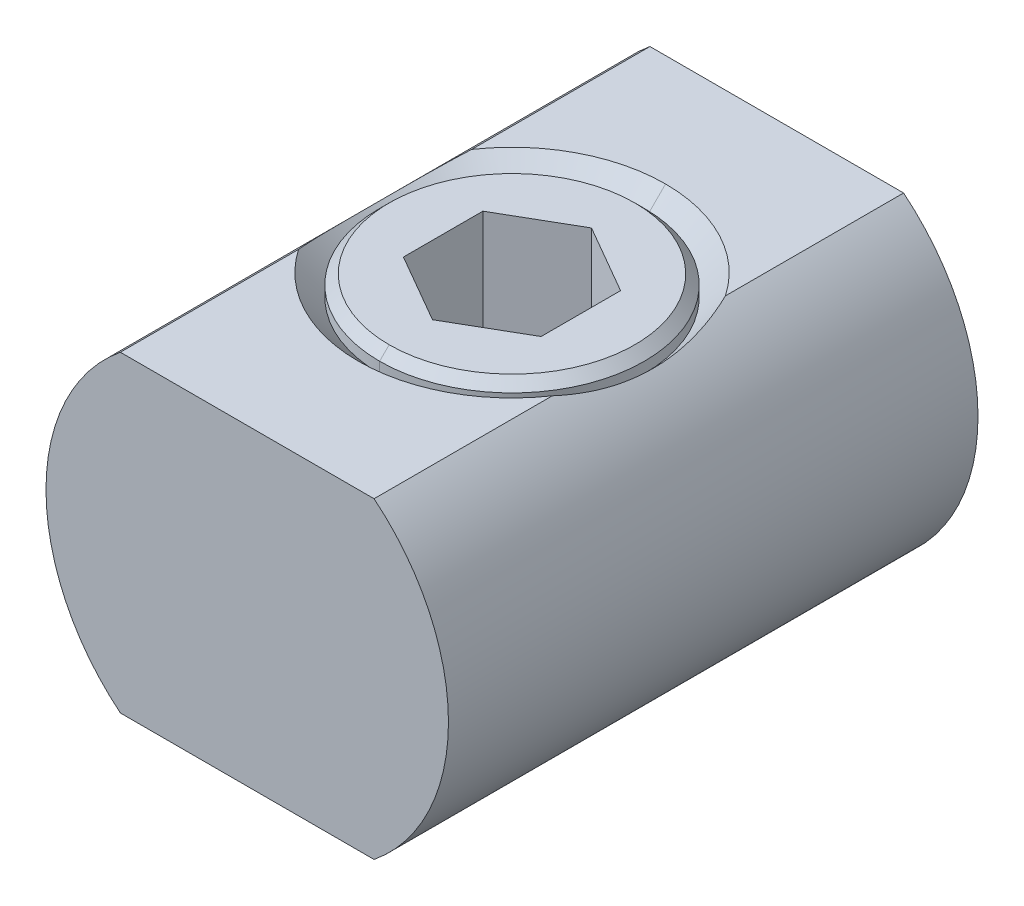
ISO-10303-21;
HEADER;
FILE_DESCRIPTION(('STEP AP214'),'2;1');
FILE_NAME('part.step','',(''),(''),'','','');
FILE_SCHEMA(('AUTOMOTIVE_DESIGN { 1 0 10303 214 1 1 1 1 }'));
ENDSEC;
DATA;
#1=APPLICATION_CONTEXT('core data for automotive mechanical design processes');
#2=APPLICATION_PROTOCOL_DEFINITION('international standard','automotive_design',2000,#1);
#3=PRODUCT_CONTEXT('',#1,'mechanical');
#4=PRODUCT('Part','Part','',(#3));
#5=PRODUCT_RELATED_PRODUCT_CATEGORY('part','',(#4));
#6=PRODUCT_DEFINITION_FORMATION('','',#4);
#7=PRODUCT_DEFINITION_CONTEXT('part definition',#1,'design');
#8=PRODUCT_DEFINITION('design','',#6,#7);
#9=PRODUCT_DEFINITION_SHAPE('','',#8);
#10=(LENGTH_UNIT() NAMED_UNIT(*) SI_UNIT(.MILLI.,.METRE.));
#11=(NAMED_UNIT(*) PLANE_ANGLE_UNIT() SI_UNIT($,.RADIAN.));
#12=(NAMED_UNIT(*) SI_UNIT($,.STERADIAN.) SOLID_ANGLE_UNIT());
#13=UNCERTAINTY_MEASURE_WITH_UNIT(LENGTH_MEASURE(1.E-05),#10,'distance_accuracy_value','');
#14=(GEOMETRIC_REPRESENTATION_CONTEXT(3) GLOBAL_UNCERTAINTY_ASSIGNED_CONTEXT((#13)) GLOBAL_UNIT_ASSIGNED_CONTEXT((#10,
#11,#12)) REPRESENTATION_CONTEXT('',''));
#15=CARTESIAN_POINT('',(0.,0.,0.));
#16=DIRECTION('',(0.,0.,1.));
#17=DIRECTION('',(1.,0.,0.));
#18=AXIS2_PLACEMENT_3D('',#15,#16,#17);
#19=CARTESIAN_POINT('',(0.,2.95,0.));
#20=DIRECTION('',(0.,-1.,0.));
#21=DIRECTION('',(1.,0.,0.));
#22=AXIS2_PLACEMENT_3D('',#19,#20,#21);
#23=CONICAL_SURFACE('',#22,1.15,0.785398163397448);
#24=DIRECTION('',(0.,-0.707106781186548,0.707106781186548));
#25=VECTOR('',#24,1.);
#26=CARTESIAN_POINT('',(0.,2.94,1.16));
#27=LINE('',#26,#25);
#28=CARTESIAN_POINT('',(0.,2.94,1.16));
#29=VERTEX_POINT('',#28);
#30=CARTESIAN_POINT('',(0.,2.85,1.25));
#31=VERTEX_POINT('',#30);
#32=EDGE_CURVE('E11',#29,#31,#27,.T.);
#33=ORIENTED_EDGE('',*,*,#32,.F.);
#34=CARTESIAN_POINT('',(0.,2.94,0.));
#35=DIRECTION('',(0.,1.,0.));
#36=DIRECTION('',(0.,0.,1.));
#37=AXIS2_PLACEMENT_3D('',#34,#35,#36);
#38=CIRCLE('',#37,1.16);
#39=CARTESIAN_POINT('',(0.,2.94,-1.16));
#40=VERTEX_POINT('',#39);
#41=EDGE_CURVE('E25',#40,#29,#38,.T.);
#42=ORIENTED_EDGE('',*,*,#41,.F.);
#43=DIRECTION('',(0.,-0.707106781186548,-0.707106781186548));
#44=VECTOR('',#43,1.);
#45=CARTESIAN_POINT('',(0.,2.94,-1.16));
#46=LINE('',#45,#44);
#47=CARTESIAN_POINT('',(0.,2.85,-1.25));
#48=VERTEX_POINT('',#47);
#49=EDGE_CURVE('E384',#40,#48,#46,.T.);
#50=ORIENTED_EDGE('',*,*,#49,.T.);
#51=CARTESIAN_POINT('',(0.,2.85,0.));
#52=DIRECTION('',(0.,-1.,0.));
#53=DIRECTION('',(0.,0.,-1.));
#54=AXIS2_PLACEMENT_3D('',#51,#52,#53);
#55=CIRCLE('',#54,1.25);
#56=EDGE_CURVE('E379',#31,#48,#55,.T.);
#57=ORIENTED_EDGE('',*,*,#56,.F.);
#58=EDGE_LOOP('',(#33,#42,#50,#57));
#59=FACE_BOUND('',#58,.T.);
#60=ADVANCED_FACE('F17',(#59),#23,.T.);
#61=CARTESIAN_POINT('',(0.,0.,0.));
#62=DIRECTION('',(0.,-1.,0.));
#63=DIRECTION('',(1.,0.,0.));
#64=AXIS2_PLACEMENT_3D('',#61,#62,#63);
#65=CYLINDRICAL_SURFACE('',#64,1.25);
#66=DIRECTION('',(0.,-1.,0.));
#67=VECTOR('',#66,1.);
#68=CARTESIAN_POINT('',(0.,2.85,1.25));
#69=LINE('',#68,#67);
#70=CARTESIAN_POINT('',(0.,2.75,1.25));
#71=VERTEX_POINT('',#70);
#72=EDGE_CURVE('E374',#31,#71,#69,.T.);
#73=ORIENTED_EDGE('',*,*,#72,.F.);
#74=ORIENTED_EDGE('',*,*,#56,.T.);
#75=DIRECTION('',(0.,-1.,0.));
#76=VECTOR('',#75,1.);
#77=CARTESIAN_POINT('',(0.,2.85,-1.25));
#78=LINE('',#77,#76);
#79=CARTESIAN_POINT('',(0.,2.75,-1.25));
#80=VERTEX_POINT('',#79);
#81=EDGE_CURVE('E370',#48,#80,#78,.T.);
#82=ORIENTED_EDGE('',*,*,#81,.T.);
#83=CARTESIAN_POINT('',(0.,2.75,0.));
#84=DIRECTION('',(0.,-1.,0.));
#85=DIRECTION('',(0.,0.,-1.));
#86=AXIS2_PLACEMENT_3D('',#83,#84,#85);
#87=CIRCLE('',#86,1.25);
#88=EDGE_CURVE('E365',#71,#80,#87,.T.);
#89=ORIENTED_EDGE('',*,*,#88,.F.);
#90=EDGE_LOOP('',(#73,#74,#82,#89));
#91=FACE_BOUND('',#90,.T.);
#92=ADVANCED_FACE('F343',(#91),#65,.T.);
#93=CARTESIAN_POINT('',(0.,2.75,0.));
#94=DIRECTION('',(0.,1.,0.));
#95=DIRECTION('',(1.,0.,0.));
#96=AXIS2_PLACEMENT_3D('',#93,#94,#95);
#97=CONICAL_SURFACE('',#96,1.25,0.785398163397447);
#98=DIRECTION('',(0.,0.707106781186549,-0.707106781186546));
#99=VECTOR('',#98,1.);
#100=CARTESIAN_POINT('',(0.,2.75,-1.25));
#101=LINE('',#100,#99);
#102=CARTESIAN_POINT('',(0.,2.95,-1.45));
#103=VERTEX_POINT('',#102);
#104=EDGE_CURVE('E361',#80,#103,#101,.T.);
#105=ORIENTED_EDGE('',*,*,#104,.T.);
#106=CARTESIAN_POINT('',(0.,2.95,0.));
#107=DIRECTION('',(0.,-1.,0.));
#108=DIRECTION('',(0.,0.,-1.));
#109=AXIS2_PLACEMENT_3D('',#106,#107,#108);
#110=CIRCLE('',#109,1.45);
#111=CARTESIAN_POINT('',(-1.1976539567003,2.95,-0.817389136213661));
#112=VERTEX_POINT('',#111);
#113=EDGE_CURVE('E358',#112,#103,#110,.T.);
#114=ORIENTED_EDGE('',*,*,#113,.F.);
#115=CARTESIAN_POINT('',(-1.1976539567003,2.95,0.817389136213661));
#116=CARTESIAN_POINT('',(-1.20499943906959,2.94403534099518,0.796044876758266));
#117=CARTESIAN_POINT('',(-1.21203600378579,2.93823115801739,0.774549421791333));
#118=CARTESIAN_POINT('',(-1.22551400414405,2.9269617962507,0.731225894182507));
#119=CARTESIAN_POINT('',(-1.23195400022894,2.9214974474256,0.709397157807462));
#120=CARTESIAN_POINT('',(-1.24423674402112,2.91094585609487,0.665442832619522));
#121=CARTESIAN_POINT('',(-1.25007853287409,2.90585922249975,0.643316829595896));
#122=CARTESIAN_POINT('',(-1.26116203711495,2.89609989356746,0.598803638407146));
#123=CARTESIAN_POINT('',(-1.2664032399539,2.89142755255154,0.576416244856476));
#124=CARTESIAN_POINT('',(-1.27628251044217,2.88253228688181,0.531416017461366));
#125=CARTESIAN_POINT('',(-1.28092047794947,2.87830943686826,0.508803146855023));
#126=CARTESIAN_POINT('',(-1.28958943539995,2.87034716682095,0.463387730011034));
#127=CARTESIAN_POINT('',(-1.29362070250864,2.86660752614853,0.440585275437996));
#128=CARTESIAN_POINT('',(-1.30107166325794,2.85964381821113,0.394826528792098));
#129=CARTESIAN_POINT('',(-1.30449197468232,2.85641923049012,0.37187041675068));
#130=CARTESIAN_POINT('',(-1.31071440081976,2.85051667981493,0.3258401094905));
#131=CARTESIAN_POINT('',(-1.31351743612449,2.84783790330247,0.302766143352973));
#132=CARTESIAN_POINT('',(-1.31849999043289,2.84305324126789,0.25653637130887));
#133=CARTESIAN_POINT('',(-1.32068068557431,2.84094627547649,0.23338080463088));
#134=CARTESIAN_POINT('',(-1.3244038493367,2.83733666497289,0.186984326875741));
#135=CARTESIAN_POINT('',(-1.32594667924238,2.83583367818258,0.163743471652671));
#136=CARTESIAN_POINT('',(-1.32839172834965,2.83344703885945,0.117138227337522));
#137=CARTESIAN_POINT('',(-1.32929234058334,2.83256493999357,0.0937736747145921));
#138=CARTESIAN_POINT('',(-1.33047031586558,2.8314104857062,0.0469650829009063));
#139=CARTESIAN_POINT('',(-1.33074636824734,2.8311394125539,0.0235209797630228));
#140=CARTESIAN_POINT('',(-1.33068153274638,2.83120303039267,-0.0234013232265701));
#141=CARTESIAN_POINT('',(-1.33033969967211,2.8315386494528,-0.0468795203277396));
#142=CARTESIAN_POINT('',(-1.32904510073533,2.83280703290893,-0.0938242723043985));
#143=CARTESIAN_POINT('',(-1.32809177652428,2.83374034305147,-0.117290796903706));
#144=CARTESIAN_POINT('',(-1.32557720137083,2.8361936553676,-0.164166503616943));
#145=CARTESIAN_POINT('',(-1.3240157942358,2.83771380827718,-0.18757566944181));
#146=CARTESIAN_POINT('',(-1.32028598643623,2.84132779872265,-0.234290904625189));
#147=CARTESIAN_POINT('',(-1.31811784795126,2.84342138845784,-0.257597014107292));
#148=CARTESIAN_POINT('',(-1.31317316192843,2.84816713306461,-0.304060302021385));
#149=CARTESIAN_POINT('',(-1.31039731195929,2.85081864738139,-0.32721762012797));
#150=CARTESIAN_POINT('',(-1.30423441693467,2.85666225415219,-0.373337605739606));
#151=CARTESIAN_POINT('',(-1.30084852168582,2.85985332896384,-0.396300555769178));
#152=CARTESIAN_POINT('',(-1.29345862830044,2.86675798910105,-0.441985444385642));
#153=CARTESIAN_POINT('',(-1.28945625585148,2.87047019794749,-0.464707853555147));
#154=CARTESIAN_POINT('',(-1.28082640492113,2.87839511576093,-0.509903692807996));
#155=CARTESIAN_POINT('',(-1.27620001046081,2.88260695529726,-0.532377483110251));
#156=CARTESIAN_POINT('',(-1.26634472854237,2.89147984407849,-0.577124289452938));
#157=CARTESIAN_POINT('',(-1.26111531377511,2.89614128588512,-0.599397111126049));
#158=CARTESIAN_POINT('',(-1.25005034013955,2.90588379439506,-0.643709278484981));
#159=CARTESIAN_POINT('',(-1.24421453204225,2.91096503345875,-0.665748524036783));
#160=CARTESIAN_POINT('',(-1.23194141152339,2.92150816556906,-0.709561621221625));
#161=CARTESIAN_POINT('',(-1.22550422259579,2.9269699804059,-0.73133552630888));
#162=CARTESIAN_POINT('',(-1.21203023042744,2.93823597986533,-0.774585306120801));
#163=CARTESIAN_POINT('',(-1.20499395747761,2.94403986032944,-0.796061425249165));
#164=CARTESIAN_POINT('',(-1.1976539567003,2.95,-0.81738913621366));
#165=B_SPLINE_CURVE_WITH_KNOTS('',3,(#115,#116,#117,#118,#119,#120,#121,#122,#123,#124,#125,
#126,#127,#128,#129,#130,#131,#132,#133,#134,#135,#136,#137,#138,#139,#140,#141,#142,#143,#144,
#145,#146,#147,#148,#149,#150,#151,#152,#153,#154,#155,#156,#157,#158,#159,#160,#161,#162,#163,
#164),.UNSPECIFIED.,.F.,.F.,(4,2,2,2,2,2,2,2,2,2,2,2,2,2,2,2,2,2,2,2,2,2,2,2,4),(0.,
0.0700397975524778,0.14024442770659,0.210559881720511,0.280934903964581,0.351321594168754,
0.421676030607221,0.491958918559779,0.562136267459855,0.632180098964353,0.702184203349884,
0.772362864319781,0.84268866228395,0.913122130062129,0.983620001903582,1.05413599383523,
1.12462156145893,1.1950266416913,1.26530038555222,1.33539188956132,1.40536316553743,
1.4753960984086,1.54545792968426,1.61550540520953,1.68549150893796),.UNSPECIFIED.);
#166=CARTESIAN_POINT('',(-1.1976539567003,2.95,0.817389136213661));
#167=VERTEX_POINT('',#166);
#168=EDGE_CURVE('E285',#167,#112,#165,.T.);
#169=ORIENTED_EDGE('',*,*,#168,.F.);
#170=CARTESIAN_POINT('',(0.,2.95,0.));
#171=DIRECTION('',(0.,-1.,0.));
#172=DIRECTION('',(0.,0.,-1.));
#173=AXIS2_PLACEMENT_3D('',#170,#171,#172);
#174=CIRCLE('',#173,1.45);
#175=CARTESIAN_POINT('',(0.,2.95,1.45));
#176=VERTEX_POINT('',#175);
#177=EDGE_CURVE('E410',#176,#167,#174,.T.);
#178=ORIENTED_EDGE('',*,*,#177,.F.);
#179=DIRECTION('',(0.,0.707106781186549,0.707106781186546));
#180=VECTOR('',#179,1.);
#181=CARTESIAN_POINT('',(0.,2.75,1.25));
#182=LINE('',#181,#180);
#183=EDGE_CURVE('E408',#71,#176,#182,.T.);
#184=ORIENTED_EDGE('',*,*,#183,.F.);
#185=ORIENTED_EDGE('',*,*,#88,.T.);
#186=EDGE_LOOP('',(#105,#114,#169,#178,#184,#185));
#187=FACE_BOUND('',#186,.T.);
#188=ADVANCED_FACE('F339',(#187),#97,.F.);
#189=CARTESIAN_POINT('',(0.,2.75,0.));
#190=DIRECTION('',(0.,1.,0.));
#191=DIRECTION('',(-1.,0.,0.));
#192=AXIS2_PLACEMENT_3D('',#189,#190,#191);
#193=CONICAL_SURFACE('',#192,1.25,0.785398163397447);
#194=ORIENTED_EDGE('',*,*,#104,.F.);
#195=CARTESIAN_POINT('',(0.,2.75,0.));
#196=DIRECTION('',(0.,-1.,0.));
#197=DIRECTION('',(0.,0.,-1.));
#198=AXIS2_PLACEMENT_3D('',#195,#196,#197);
#199=CIRCLE('',#198,1.25);
#200=EDGE_CURVE('E412',#80,#71,#199,.T.);
#201=ORIENTED_EDGE('',*,*,#200,.T.);
#202=ORIENTED_EDGE('',*,*,#183,.T.);
#203=CARTESIAN_POINT('',(0.,2.95,0.));
#204=DIRECTION('',(0.,-1.,0.));
#205=DIRECTION('',(0.,0.,-1.));
#206=AXIS2_PLACEMENT_3D('',#203,#204,#205);
#207=CIRCLE('',#206,1.45);
#208=CARTESIAN_POINT('',(1.1976539567003,2.95,0.817389136213666));
#209=VERTEX_POINT('',#208);
#210=EDGE_CURVE('E414',#209,#176,#207,.T.);
#211=ORIENTED_EDGE('',*,*,#210,.F.);
#212=CARTESIAN_POINT('',(1.1976539567003,2.95,-0.817389136213663));
#213=CARTESIAN_POINT('',(1.20499943906959,2.94403534099518,-0.796044876758269));
#214=CARTESIAN_POINT('',(1.21203600378579,2.93823115801739,-0.774549421791335));
#215=CARTESIAN_POINT('',(1.22551400414405,2.92696179625069,-0.731225894182509));
#216=CARTESIAN_POINT('',(1.23195400022893,2.9214974474256,-0.709397157807463));
#217=CARTESIAN_POINT('',(1.24423674402112,2.91094585609487,-0.665442832619523));
#218=CARTESIAN_POINT('',(1.25007853287408,2.90585922249974,-0.643316829595897));
#219=CARTESIAN_POINT('',(1.26116203711495,2.89609989356745,-0.598803638407147));
#220=CARTESIAN_POINT('',(1.2664032399539,2.89142755255154,-0.576416244856477));
#221=CARTESIAN_POINT('',(1.27628251044216,2.8825322868818,-0.531416017461367));
#222=CARTESIAN_POINT('',(1.28092047794947,2.87830943686826,-0.508803146855024));
#223=CARTESIAN_POINT('',(1.28958943539994,2.87034716682095,-0.463387730011035));
#224=CARTESIAN_POINT('',(1.29362070250863,2.86660752614853,-0.440585275437997));
#225=CARTESIAN_POINT('',(1.30107166325794,2.85964381821113,-0.394826528792098));
#226=CARTESIAN_POINT('',(1.30449197468232,2.85641923049012,-0.37187041675068));
#227=CARTESIAN_POINT('',(1.31071440081976,2.85051667981492,-0.325840109490501));
#228=CARTESIAN_POINT('',(1.31351743612448,2.84783790330247,-0.302766143352974));
#229=CARTESIAN_POINT('',(1.31849999043289,2.84305324126788,-0.25653637130887));
#230=CARTESIAN_POINT('',(1.3206806855743,2.84094627547649,-0.23338080463088));
#231=CARTESIAN_POINT('',(1.32440384933669,2.83733666497288,-0.186984326875741));
#232=CARTESIAN_POINT('',(1.32594667924237,2.83583367818258,-0.163743471652671));
#233=CARTESIAN_POINT('',(1.32839172834965,2.83344703885945,-0.117138227337522));
#234=CARTESIAN_POINT('',(1.32929234058333,2.83256493999357,-0.0937736747145917));
#235=CARTESIAN_POINT('',(1.33047031586557,2.8314104857062,-0.0469650829009056));
#236=CARTESIAN_POINT('',(1.33074636824733,2.8311394125539,-0.0235209797630217));
#237=CARTESIAN_POINT('',(1.33068153274637,2.83120303039266,0.0234013232265716));
#238=CARTESIAN_POINT('',(1.33033969967211,2.83153864945279,0.0468795203277412));
#239=CARTESIAN_POINT('',(1.32904510073533,2.83280703290893,0.0938242723043996));
#240=CARTESIAN_POINT('',(1.32809177652428,2.83374034305146,0.117290796903706));
#241=CARTESIAN_POINT('',(1.32557720137082,2.8361936553676,0.164166503616944));
#242=CARTESIAN_POINT('',(1.3240157942358,2.83771380827718,0.187575669441811));
#243=CARTESIAN_POINT('',(1.32028598643622,2.84132779872265,0.234290904625191));
#244=CARTESIAN_POINT('',(1.31811784795126,2.84342138845783,0.257597014107294));
#245=CARTESIAN_POINT('',(1.31317316192843,2.84816713306461,0.304060302021387));
#246=CARTESIAN_POINT('',(1.31039731195929,2.85081864738139,0.327217620127971));
#247=CARTESIAN_POINT('',(1.30423441693467,2.85666225415219,0.373337605739608));
#248=CARTESIAN_POINT('',(1.30084852168582,2.85985332896384,0.396300555769181));
#249=CARTESIAN_POINT('',(1.29345862830043,2.86675798910105,0.441985444385646));
#250=CARTESIAN_POINT('',(1.28945625585147,2.87047019794749,0.46470785355515));
#251=CARTESIAN_POINT('',(1.28082640492113,2.87839511576093,0.509903692807999));
#252=CARTESIAN_POINT('',(1.2762000104608,2.88260695529726,0.532377483110255));
#253=CARTESIAN_POINT('',(1.26634472854236,2.89147984407849,0.577124289452941));
#254=CARTESIAN_POINT('',(1.2611153137751,2.89614128588512,0.599397111126053));
#255=CARTESIAN_POINT('',(1.25005034013955,2.90588379439506,0.643709278484985));
#256=CARTESIAN_POINT('',(1.24421453204224,2.91096503345875,0.665748524036787));
#257=CARTESIAN_POINT('',(1.23194141152339,2.92150816556906,0.70956162122163));
#258=CARTESIAN_POINT('',(1.22550422259579,2.9269699804059,0.731335526308885));
#259=CARTESIAN_POINT('',(1.21203023042744,2.93823597986533,0.774585306120806));
#260=CARTESIAN_POINT('',(1.2049939574776,2.94403986032944,0.796061425249171));
#261=CARTESIAN_POINT('',(1.1976539567003,2.95,0.817389136213666));
#262=B_SPLINE_CURVE_WITH_KNOTS('',3,(#212,#213,#214,#215,#216,#217,#218,#219,#220,#221,#222,
#223,#224,#225,#226,#227,#228,#229,#230,#231,#232,#233,#234,#235,#236,#237,#238,#239,#240,#241,
#242,#243,#244,#245,#246,#247,#248,#249,#250,#251,#252,#253,#254,#255,#256,#257,#258,#259,#260,
#261),.UNSPECIFIED.,.F.,.F.,(4,2,2,2,2,2,2,2,2,2,2,2,2,2,2,2,2,2,2,2,2,2,2,2,4),(0.,
0.0700397975524772,0.140244427706591,0.210559881720513,0.280934903964582,0.351321594168755,
0.421676030607222,0.491958918559781,0.562136267459856,0.632180098964355,0.702184203349887,
0.772362864319783,0.842688662283954,0.913122130062133,0.983620001903584,1.05413599383523,
1.12462156145894,1.19502664169131,1.26530038555222,1.33539188956132,1.40536316553744,
1.4753960984086,1.54545792968427,1.61550540520954,1.68549150893797),.UNSPECIFIED.);
#263=CARTESIAN_POINT('',(1.1976539567003,2.95,-0.817389136213663));
#264=VERTEX_POINT('',#263);
#265=EDGE_CURVE('E321',#264,#209,#262,.T.);
#266=ORIENTED_EDGE('',*,*,#265,.F.);
#267=CARTESIAN_POINT('',(0.,2.95,0.));
#268=DIRECTION('',(0.,-1.,0.));
#269=DIRECTION('',(0.,0.,-1.));
#270=AXIS2_PLACEMENT_3D('',#267,#268,#269);
#271=CIRCLE('',#270,1.45);
#272=EDGE_CURVE('E316',#103,#264,#271,.T.);
#273=ORIENTED_EDGE('',*,*,#272,.F.);
#274=EDGE_LOOP('',(#194,#201,#202,#211,#266,#273));
#275=FACE_BOUND('',#274,.T.);
#276=ADVANCED_FACE('F329',(#275),#193,.F.);
#277=CARTESIAN_POINT('',(1.1976539567003,2.95,2.5));
#278=DIRECTION('',(0.,-1.,0.));
#279=DIRECTION('',(0.,0.,-1.));
#280=AXIS2_PLACEMENT_3D('',#277,#278,#279);
#281=PLANE('',#280);
#282=DIRECTION('',(0.,0.,-1.));
#283=VECTOR('',#282,1.);
#284=CARTESIAN_POINT('',(-1.1976539567003,2.95,2.5));
#285=LINE('',#284,#283);
#286=CARTESIAN_POINT('',(-1.1976539567003,2.95,-2.5));
#287=VERTEX_POINT('',#286);
#288=EDGE_CURVE('E312',#112,#287,#285,.T.);
#289=ORIENTED_EDGE('',*,*,#288,.F.);
#290=ORIENTED_EDGE('',*,*,#113,.T.);
#291=ORIENTED_EDGE('',*,*,#272,.T.);
#292=DIRECTION('',(0.,0.,-1.));
#293=VECTOR('',#292,1.);
#294=CARTESIAN_POINT('',(1.1976539567003,2.95,2.5));
#295=LINE('',#294,#293);
#296=CARTESIAN_POINT('',(1.1976539567003,2.95,-2.5));
#297=VERTEX_POINT('',#296);
#298=EDGE_CURVE('E308',#264,#297,#295,.T.);
#299=ORIENTED_EDGE('',*,*,#298,.T.);
#300=DIRECTION('',(-1.,0.,0.));
#301=VECTOR('',#300,1.);
#302=CARTESIAN_POINT('',(1.1976539567003,2.95,-2.5));
#303=LINE('',#302,#301);
#304=EDGE_CURVE('E304',#297,#287,#303,.T.);
#305=ORIENTED_EDGE('',*,*,#304,.T.);
#306=EDGE_LOOP('',(#289,#290,#291,#299,#305));
#307=FACE_BOUND('',#306,.T.);
#308=ADVANCED_FACE('F338',(#307),#281,.F.);
#309=CARTESIAN_POINT('',(0.,1.475,-2.5));
#310=DIRECTION('',(0.,0.,1.));
#311=DIRECTION('',(1.,0.,0.));
#312=AXIS2_PLACEMENT_3D('',#309,#310,#311);
#313=PLANE('',#312);
#314=ORIENTED_EDGE('',*,*,#304,.F.);
#315=CARTESIAN_POINT('',(0.,1.475,-2.5));
#316=DIRECTION('',(0.,0.,1.));
#317=DIRECTION('',(1.,0.,0.));
#318=AXIS2_PLACEMENT_3D('',#315,#316,#317);
#319=CIRCLE('',#318,1.89999999999992);
#320=CARTESIAN_POINT('',(1.1976539567003,0.,-2.5));
#321=VERTEX_POINT('',#320);
#322=EDGE_CURVE('E299',#321,#297,#319,.T.);
#323=ORIENTED_EDGE('',*,*,#322,.F.);
#324=DIRECTION('',(1.,0.,0.));
#325=VECTOR('',#324,1.);
#326=CARTESIAN_POINT('',(-1.1976539567003,0.,-2.5));
#327=LINE('',#326,#325);
#328=CARTESIAN_POINT('',(-1.1976539567003,0.,-2.5));
#329=VERTEX_POINT('',#328);
#330=EDGE_CURVE('E294',#329,#321,#327,.T.);
#331=ORIENTED_EDGE('',*,*,#330,.F.);
#332=CARTESIAN_POINT('',(0.,1.475,-2.5));
#333=DIRECTION('',(0.,0.,1.));
#334=DIRECTION('',(1.,0.,0.));
#335=AXIS2_PLACEMENT_3D('',#332,#333,#334);
#336=CIRCLE('',#335,1.89999999999992);
#337=EDGE_CURVE('E288',#287,#329,#336,.T.);
#338=ORIENTED_EDGE('',*,*,#337,.F.);
#339=EDGE_LOOP('',(#314,#323,#331,#338));
#340=FACE_BOUND('',#339,.T.);
#341=ADVANCED_FACE('F266',(#340),#313,.F.);
#342=CARTESIAN_POINT('',(0.,1.475,2.5));
#343=DIRECTION('',(0.,0.,-1.));
#344=DIRECTION('',(1.,0.,0.));
#345=AXIS2_PLACEMENT_3D('',#342,#343,#344);
#346=CYLINDRICAL_SURFACE('',#345,1.89999999999992);
#347=DIRECTION('',(0.,0.,-1.));
#348=VECTOR('',#347,1.);
#349=CARTESIAN_POINT('',(-1.1976539567003,2.95,2.5));
#350=LINE('',#349,#348);
#351=CARTESIAN_POINT('',(-1.1976539567003,2.95,2.5));
#352=VERTEX_POINT('',#351);
#353=EDGE_CURVE('E286',#352,#167,#350,.T.);
#354=ORIENTED_EDGE('',*,*,#353,.T.);
#355=ORIENTED_EDGE('',*,*,#168,.T.);
#356=ORIENTED_EDGE('',*,*,#288,.T.);
#357=ORIENTED_EDGE('',*,*,#337,.T.);
#358=DIRECTION('',(0.,0.,-1.));
#359=VECTOR('',#358,1.);
#360=CARTESIAN_POINT('',(-1.1976539567003,0.,2.5));
#361=LINE('',#360,#359);
#362=CARTESIAN_POINT('',(-1.1976539567003,0.,2.5));
#363=VERTEX_POINT('',#362);
#364=EDGE_CURVE('E289',#363,#329,#361,.T.);
#365=ORIENTED_EDGE('',*,*,#364,.F.);
#366=CARTESIAN_POINT('',(0.,1.475,2.5));
#367=DIRECTION('',(0.,0.,1.));
#368=DIRECTION('',(1.,0.,0.));
#369=AXIS2_PLACEMENT_3D('',#366,#367,#368);
#370=CIRCLE('',#369,1.89999999999992);
#371=EDGE_CURVE('E433',#352,#363,#370,.T.);
#372=ORIENTED_EDGE('',*,*,#371,.F.);
#373=EDGE_LOOP('',(#354,#355,#356,#357,#365,#372));
#374=FACE_BOUND('',#373,.T.);
#375=ADVANCED_FACE('F261',(#374),#346,.T.);
#376=CARTESIAN_POINT('',(0.,1.475,2.5));
#377=DIRECTION('',(0.,0.,1.));
#378=DIRECTION('',(1.,0.,0.));
#379=AXIS2_PLACEMENT_3D('',#376,#377,#378);
#380=PLANE('',#379);
#381=DIRECTION('',(-1.,0.,0.));
#382=VECTOR('',#381,1.);
#383=CARTESIAN_POINT('',(1.1976539567003,2.95,2.5));
#384=LINE('',#383,#382);
#385=CARTESIAN_POINT('',(1.1976539567003,2.95,2.5));
#386=VERTEX_POINT('',#385);
#387=EDGE_CURVE('E431',#386,#352,#384,.T.);
#388=ORIENTED_EDGE('',*,*,#387,.T.);
#389=ORIENTED_EDGE('',*,*,#371,.T.);
#390=DIRECTION('',(1.,0.,0.));
#391=VECTOR('',#390,1.);
#392=CARTESIAN_POINT('',(-1.1976539567003,0.,2.5));
#393=LINE('',#392,#391);
#394=CARTESIAN_POINT('',(1.1976539567003,0.,2.5));
#395=VERTEX_POINT('',#394);
#396=EDGE_CURVE('E434',#363,#395,#393,.T.);
#397=ORIENTED_EDGE('',*,*,#396,.T.);
#398=CARTESIAN_POINT('',(0.,1.475,2.5));
#399=DIRECTION('',(0.,0.,1.));
#400=DIRECTION('',(1.,0.,0.));
#401=AXIS2_PLACEMENT_3D('',#398,#399,#400);
#402=CIRCLE('',#401,1.89999999999992);
#403=EDGE_CURVE('E236',#395,#386,#402,.T.);
#404=ORIENTED_EDGE('',*,*,#403,.T.);
#405=EDGE_LOOP('',(#388,#389,#397,#404));
#406=FACE_BOUND('',#405,.T.);
#407=ADVANCED_FACE('F256',(#406),#380,.T.);
#408=CARTESIAN_POINT('',(0.,1.475,2.5));
#409=DIRECTION('',(0.,0.,-1.));
#410=DIRECTION('',(-1.,0.,0.));
#411=AXIS2_PLACEMENT_3D('',#408,#409,#410);
#412=CYLINDRICAL_SURFACE('',#411,1.89999999999992);
#413=ORIENTED_EDGE('',*,*,#298,.F.);
#414=ORIENTED_EDGE('',*,*,#265,.T.);
#415=DIRECTION('',(0.,0.,-1.));
#416=VECTOR('',#415,1.);
#417=CARTESIAN_POINT('',(1.1976539567003,2.95,2.5));
#418=LINE('',#417,#416);
#419=EDGE_CURVE('E231',#386,#209,#418,.T.);
#420=ORIENTED_EDGE('',*,*,#419,.F.);
#421=ORIENTED_EDGE('',*,*,#403,.F.);
#422=DIRECTION('',(0.,0.,-1.));
#423=VECTOR('',#422,1.);
#424=CARTESIAN_POINT('',(1.1976539567003,0.,2.5));
#425=LINE('',#424,#423);
#426=EDGE_CURVE('E226',#395,#321,#425,.T.);
#427=ORIENTED_EDGE('',*,*,#426,.T.);
#428=ORIENTED_EDGE('',*,*,#322,.T.);
#429=EDGE_LOOP('',(#413,#414,#420,#421,#427,#428));
#430=FACE_BOUND('',#429,.T.);
#431=ADVANCED_FACE('F245',(#430),#412,.T.);
#432=CARTESIAN_POINT('',(-1.1976539567003,0.,2.5));
#433=DIRECTION('',(0.,1.,0.));
#434=DIRECTION('',(0.,0.,1.));
#435=AXIS2_PLACEMENT_3D('',#432,#433,#434);
#436=PLANE('',#435);
#437=ORIENTED_EDGE('',*,*,#330,.T.);
#438=ORIENTED_EDGE('',*,*,#426,.F.);
#439=ORIENTED_EDGE('',*,*,#396,.F.);
#440=ORIENTED_EDGE('',*,*,#364,.T.);
#441=EDGE_LOOP('',(#437,#438,#439,#440));
#442=FACE_BOUND('',#441,.T.);
#443=ADVANCED_FACE('F255',(#442),#436,.F.);
#444=CARTESIAN_POINT('',(1.1976539567003,2.95,2.5));
#445=DIRECTION('',(0.,-1.,0.));
#446=DIRECTION('',(0.,0.,-1.));
#447=AXIS2_PLACEMENT_3D('',#444,#445,#446);
#448=PLANE('',#447);
#449=ORIENTED_EDGE('',*,*,#419,.T.);
#450=ORIENTED_EDGE('',*,*,#210,.T.);
#451=ORIENTED_EDGE('',*,*,#177,.T.);
#452=ORIENTED_EDGE('',*,*,#353,.F.);
#453=ORIENTED_EDGE('',*,*,#387,.F.);
#454=EDGE_LOOP('',(#449,#450,#451,#452,#453));
#455=FACE_BOUND('',#454,.T.);
#456=ADVANCED_FACE('F428',(#455),#448,.F.);
#457=CARTESIAN_POINT('',(0.,0.,0.));
#458=DIRECTION('',(0.,-1.,0.));
#459=DIRECTION('',(-1.,0.,0.));
#460=AXIS2_PLACEMENT_3D('',#457,#458,#459);
#461=CYLINDRICAL_SURFACE('',#460,1.25);
#462=ORIENTED_EDGE('',*,*,#72,.T.);
#463=ORIENTED_EDGE('',*,*,#200,.F.);
#464=ORIENTED_EDGE('',*,*,#81,.F.);
#465=CARTESIAN_POINT('',(0.,2.85,0.));
#466=DIRECTION('',(0.,-1.,0.));
#467=DIRECTION('',(0.,0.,-1.));
#468=AXIS2_PLACEMENT_3D('',#465,#466,#467);
#469=CIRCLE('',#468,1.25);
#470=EDGE_CURVE('E221',#48,#31,#469,.T.);
#471=ORIENTED_EDGE('',*,*,#470,.T.);
#472=EDGE_LOOP('',(#462,#463,#464,#471));
#473=FACE_BOUND('',#472,.T.);
#474=ADVANCED_FACE('F402',(#473),#461,.T.);
#475=CARTESIAN_POINT('',(0.,2.95,0.));
#476=DIRECTION('',(0.,-1.,0.));
#477=DIRECTION('',(-1.,0.,0.));
#478=AXIS2_PLACEMENT_3D('',#475,#476,#477);
#479=CONICAL_SURFACE('',#478,1.15,0.785398163397448);
#480=ORIENTED_EDGE('',*,*,#32,.T.);
#481=ORIENTED_EDGE('',*,*,#470,.F.);
#482=ORIENTED_EDGE('',*,*,#49,.F.);
#483=CARTESIAN_POINT('',(0.,2.94,0.));
#484=DIRECTION('',(0.,1.,0.));
#485=DIRECTION('',(0.,0.,1.));
#486=AXIS2_PLACEMENT_3D('',#483,#484,#485);
#487=CIRCLE('',#486,1.16);
#488=EDGE_CURVE('E217',#29,#40,#487,.T.);
#489=ORIENTED_EDGE('',*,*,#488,.F.);
#490=EDGE_LOOP('',(#480,#481,#482,#489));
#491=FACE_BOUND('',#490,.T.);
#492=ADVANCED_FACE('F397',(#491),#479,.T.);
#493=CARTESIAN_POINT('',(0.,2.94,0.));
#494=DIRECTION('',(0.,1.,0.));
#495=DIRECTION('',(0.,0.,1.));
#496=AXIS2_PLACEMENT_3D('',#493,#494,#495);
#497=PLANE('',#496);
#498=DIRECTION('',(0.,0.,-1.));
#499=VECTOR('',#498,1.);
#500=CARTESIAN_POINT('',(-0.65,2.94,-0.37527767497326));
#501=LINE('',#500,#499);
#502=CARTESIAN_POINT('',(-0.65,2.94,0.37527767497326));
#503=VERTEX_POINT('',#502);
#504=CARTESIAN_POINT('',(-0.65,2.94,-0.37527767497326));
#505=VERTEX_POINT('',#504);
#506=EDGE_CURVE('E213',#503,#505,#501,.T.);
#507=ORIENTED_EDGE('',*,*,#506,.T.);
#508=DIRECTION('',(0.866025403784443,0.,-0.499999999999993));
#509=VECTOR('',#508,1.);
#510=CARTESIAN_POINT('',(0.,2.94,-0.75055534994651));
#511=LINE('',#510,#509);
#512=CARTESIAN_POINT('',(0.,2.94,-0.75055534994651));
#513=VERTEX_POINT('',#512);
#514=EDGE_CURVE('E209',#505,#513,#511,.T.);
#515=ORIENTED_EDGE('',*,*,#514,.T.);
#516=DIRECTION('',(0.866025403784443,0.,0.499999999999993));
#517=VECTOR('',#516,1.);
#518=CARTESIAN_POINT('',(0.65,2.94,-0.37527767497326));
#519=LINE('',#518,#517);
#520=CARTESIAN_POINT('',(0.65,2.94,-0.37527767497326));
#521=VERTEX_POINT('',#520);
#522=EDGE_CURVE('E205',#513,#521,#519,.T.);
#523=ORIENTED_EDGE('',*,*,#522,.T.);
#524=DIRECTION('',(0.,0.,1.));
#525=VECTOR('',#524,1.);
#526=CARTESIAN_POINT('',(0.65,2.94,0.37527767497326));
#527=LINE('',#526,#525);
#528=CARTESIAN_POINT('',(0.65,2.94,0.37527767497326));
#529=VERTEX_POINT('',#528);
#530=EDGE_CURVE('E201',#521,#529,#527,.T.);
#531=ORIENTED_EDGE('',*,*,#530,.T.);
#532=DIRECTION('',(-0.866025403784443,0.,0.499999999999993));
#533=VECTOR('',#532,1.);
#534=CARTESIAN_POINT('',(0.,2.94,0.75055534994651));
#535=LINE('',#534,#533);
#536=CARTESIAN_POINT('',(0.,2.94,0.75055534994651));
#537=VERTEX_POINT('',#536);
#538=EDGE_CURVE('E149',#529,#537,#535,.T.);
#539=ORIENTED_EDGE('',*,*,#538,.T.);
#540=DIRECTION('',(-0.866025403784443,0.,-0.499999999999993));
#541=VECTOR('',#540,1.);
#542=CARTESIAN_POINT('',(-0.65,2.94,0.37527767497326));
#543=LINE('',#542,#541);
#544=EDGE_CURVE('E194',#537,#503,#543,.T.);
#545=ORIENTED_EDGE('',*,*,#544,.T.);
#546=EDGE_LOOP('',(#507,#515,#523,#531,#539,#545));
#547=FACE_BOUND('',#546,.T.);
#548=ORIENTED_EDGE('',*,*,#488,.T.);
#549=ORIENTED_EDGE('',*,*,#41,.T.);
#550=EDGE_LOOP('',(#548,#549));
#551=FACE_BOUND('',#550,.T.);
#552=ADVANCED_FACE('F393',(#547,#551),#497,.T.);
#553=CARTESIAN_POINT('',(-0.65,1.65,0.37527767497326));
#554=DIRECTION('',(-0.499999999999993,0.,0.866025403784443));
#555=DIRECTION('',(0.866025403784443,0.,0.499999999999993));
#556=AXIS2_PLACEMENT_3D('',#553,#554,#555);
#557=PLANE('',#556);
#558=ORIENTED_EDGE('',*,*,#544,.F.);
#559=DIRECTION('',(0.,1.,0.));
#560=VECTOR('',#559,1.);
#561=CARTESIAN_POINT('',(0.,1.65,0.75055534994651));
#562=LINE('',#561,#560);
#563=CARTESIAN_POINT('',(0.,1.65,0.75055534994651));
#564=VERTEX_POINT('',#563);
#565=EDGE_CURVE('E190',#564,#537,#562,.T.);
#566=ORIENTED_EDGE('',*,*,#565,.F.);
#567=DIRECTION('',(0.866025403784443,0.,0.499999999999993));
#568=VECTOR('',#567,1.);
#569=CARTESIAN_POINT('',(-0.65,1.65,0.37527767497326));
#570=LINE('',#569,#568);
#571=CARTESIAN_POINT('',(-0.65,1.65,0.37527767497326));
#572=VERTEX_POINT('',#571);
#573=EDGE_CURVE('E144',#572,#564,#570,.T.);
#574=ORIENTED_EDGE('',*,*,#573,.F.);
#575=DIRECTION('',(0.,1.,0.));
#576=VECTOR('',#575,1.);
#577=CARTESIAN_POINT('',(-0.65,1.65,0.37527767497326));
#578=LINE('',#577,#576);
#579=EDGE_CURVE('E182',#572,#503,#578,.T.);
#580=ORIENTED_EDGE('',*,*,#579,.T.);
#581=EDGE_LOOP('',(#558,#566,#574,#580));
#582=FACE_BOUND('',#581,.T.);
#583=ADVANCED_FACE('F557',(#582),#557,.F.);
#584=CARTESIAN_POINT('',(-0.65,1.65,-0.37527767497326));
#585=DIRECTION('',(-1.,0.,0.));
#586=DIRECTION('',(0.,0.,1.));
#587=AXIS2_PLACEMENT_3D('',#584,#585,#586);
#588=PLANE('',#587);
#589=ORIENTED_EDGE('',*,*,#506,.F.);
#590=ORIENTED_EDGE('',*,*,#579,.F.);
#591=DIRECTION('',(0.,0.,1.));
#592=VECTOR('',#591,1.);
#593=CARTESIAN_POINT('',(-0.65,1.65,-0.37527767497326));
#594=LINE('',#593,#592);
#595=CARTESIAN_POINT('',(-0.65,1.65,-0.37527767497326));
#596=VERTEX_POINT('',#595);
#597=EDGE_CURVE('E178',#596,#572,#594,.T.);
#598=ORIENTED_EDGE('',*,*,#597,.F.);
#599=DIRECTION('',(0.,1.,0.));
#600=VECTOR('',#599,1.);
#601=CARTESIAN_POINT('',(-0.65,1.65,-0.37527767497326));
#602=LINE('',#601,#600);
#603=EDGE_CURVE('E173',#596,#505,#602,.T.);
#604=ORIENTED_EDGE('',*,*,#603,.T.);
#605=EDGE_LOOP('',(#589,#590,#598,#604));
#606=FACE_BOUND('',#605,.T.);
#607=ADVANCED_FACE('F568',(#606),#588,.F.);
#608=CARTESIAN_POINT('',(0.,1.65,-0.75055534994651));
#609=DIRECTION('',(-0.499999999999993,0.,-0.866025403784443));
#610=DIRECTION('',(-0.866025403784443,0.,0.499999999999993));
#611=AXIS2_PLACEMENT_3D('',#608,#609,#610);
#612=PLANE('',#611);
#613=ORIENTED_EDGE('',*,*,#514,.F.);
#614=ORIENTED_EDGE('',*,*,#603,.F.);
#615=DIRECTION('',(-0.866025403784443,0.,0.499999999999993));
#616=VECTOR('',#615,1.);
#617=CARTESIAN_POINT('',(0.,1.65,-0.75055534994651));
#618=LINE('',#617,#616);
#619=CARTESIAN_POINT('',(0.,1.65,-0.75055534994651));
#620=VERTEX_POINT('',#619);
#621=EDGE_CURVE('E168',#620,#596,#618,.T.);
#622=ORIENTED_EDGE('',*,*,#621,.F.);
#623=DIRECTION('',(0.,1.,0.));
#624=VECTOR('',#623,1.);
#625=CARTESIAN_POINT('',(0.,1.65,-0.75055534994651));
#626=LINE('',#625,#624);
#627=EDGE_CURVE('E163',#620,#513,#626,.T.);
#628=ORIENTED_EDGE('',*,*,#627,.T.);
#629=EDGE_LOOP('',(#613,#614,#622,#628));
#630=FACE_BOUND('',#629,.T.);
#631=ADVANCED_FACE('F579',(#630),#612,.F.);
#632=CARTESIAN_POINT('',(0.65,1.65,-0.37527767497326));
#633=DIRECTION('',(0.499999999999993,0.,-0.866025403784443));
#634=DIRECTION('',(-0.866025403784443,0.,-0.499999999999993));
#635=AXIS2_PLACEMENT_3D('',#632,#633,#634);
#636=PLANE('',#635);
#637=ORIENTED_EDGE('',*,*,#522,.F.);
#638=ORIENTED_EDGE('',*,*,#627,.F.);
#639=DIRECTION('',(-0.866025403784443,0.,-0.499999999999993));
#640=VECTOR('',#639,1.);
#641=CARTESIAN_POINT('',(0.65,1.65,-0.37527767497326));
#642=LINE('',#641,#640);
#643=CARTESIAN_POINT('',(0.65,1.65,-0.37527767497326));
#644=VERTEX_POINT('',#643);
#645=EDGE_CURVE('E159',#644,#620,#642,.T.);
#646=ORIENTED_EDGE('',*,*,#645,.F.);
#647=DIRECTION('',(0.,1.,0.));
#648=VECTOR('',#647,1.);
#649=CARTESIAN_POINT('',(0.65,1.65,-0.37527767497326));
#650=LINE('',#649,#648);
#651=EDGE_CURVE('E135',#644,#521,#650,.T.);
#652=ORIENTED_EDGE('',*,*,#651,.T.);
#653=EDGE_LOOP('',(#637,#638,#646,#652));
#654=FACE_BOUND('',#653,.T.);
#655=ADVANCED_FACE('F590',(#654),#636,.F.);
#656=CARTESIAN_POINT('',(0.65,1.65,0.37527767497326));
#657=DIRECTION('',(1.,0.,0.));
#658=DIRECTION('',(0.,0.,-1.));
#659=AXIS2_PLACEMENT_3D('',#656,#657,#658);
#660=PLANE('',#659);
#661=ORIENTED_EDGE('',*,*,#530,.F.);
#662=ORIENTED_EDGE('',*,*,#651,.F.);
#663=DIRECTION('',(0.,0.,-1.));
#664=VECTOR('',#663,1.);
#665=CARTESIAN_POINT('',(0.65,1.65,0.37527767497326));
#666=LINE('',#665,#664);
#667=CARTESIAN_POINT('',(0.65,1.65,0.37527767497326));
#668=VERTEX_POINT('',#667);
#669=EDGE_CURVE('E127',#668,#644,#666,.T.);
#670=ORIENTED_EDGE('',*,*,#669,.F.);
#671=DIRECTION('',(0.,1.,0.));
#672=VECTOR('',#671,1.);
#673=CARTESIAN_POINT('',(0.65,1.65,0.37527767497326));
#674=LINE('',#673,#672);
#675=EDGE_CURVE('E132',#668,#529,#674,.T.);
#676=ORIENTED_EDGE('',*,*,#675,.T.);
#677=EDGE_LOOP('',(#661,#662,#670,#676));
#678=FACE_BOUND('',#677,.T.);
#679=ADVANCED_FACE('F130',(#678),#660,.F.);
#680=CARTESIAN_POINT('',(0.,1.65,0.75055534994651));
#681=DIRECTION('',(0.499999999999993,0.,0.866025403784443));
#682=DIRECTION('',(0.866025403784443,0.,-0.499999999999993));
#683=AXIS2_PLACEMENT_3D('',#680,#681,#682);
#684=PLANE('',#683);
#685=ORIENTED_EDGE('',*,*,#538,.F.);
#686=ORIENTED_EDGE('',*,*,#675,.F.);
#687=DIRECTION('',(0.866025403784443,0.,-0.499999999999993));
#688=VECTOR('',#687,1.);
#689=CARTESIAN_POINT('',(0.,1.65,0.75055534994651));
#690=LINE('',#689,#688);
#691=EDGE_CURVE('E141',#564,#668,#690,.T.);
#692=ORIENTED_EDGE('',*,*,#691,.F.);
#693=ORIENTED_EDGE('',*,*,#565,.T.);
#694=EDGE_LOOP('',(#685,#686,#692,#693));
#695=FACE_BOUND('',#694,.T.);
#696=ADVANCED_FACE('F148',(#695),#684,.F.);
#697=CARTESIAN_POINT('',(0.,1.65,0.));
#698=DIRECTION('',(0.,1.,0.));
#699=DIRECTION('',(0.,0.,1.));
#700=AXIS2_PLACEMENT_3D('',#697,#698,#699);
#701=PLANE('',#700);
#702=ORIENTED_EDGE('',*,*,#597,.T.);
#703=ORIENTED_EDGE('',*,*,#573,.T.);
#704=ORIENTED_EDGE('',*,*,#691,.T.);
#705=ORIENTED_EDGE('',*,*,#669,.T.);
#706=ORIENTED_EDGE('',*,*,#645,.T.);
#707=ORIENTED_EDGE('',*,*,#621,.T.);
#708=EDGE_LOOP('',(#702,#703,#704,#705,#706,#707));
#709=FACE_BOUND('',#708,.T.);
#710=ADVANCED_FACE('F143',(#709),#701,.T.);
#711=CLOSED_SHELL('',(#60,#92,#188,#276,#308,#341,#375,#407,#431,#443,#456,#474,#492,#552,#583,
#607,#631,#655,#679,#696,#710));
#712=MANIFOLD_SOLID_BREP('B1',#711);
#713=ADVANCED_BREP_SHAPE_REPRESENTATION('',(#18,#712),#14);
#714=SHAPE_DEFINITION_REPRESENTATION(#9,#713);
ENDSEC;
END-ISO-10303-21;
